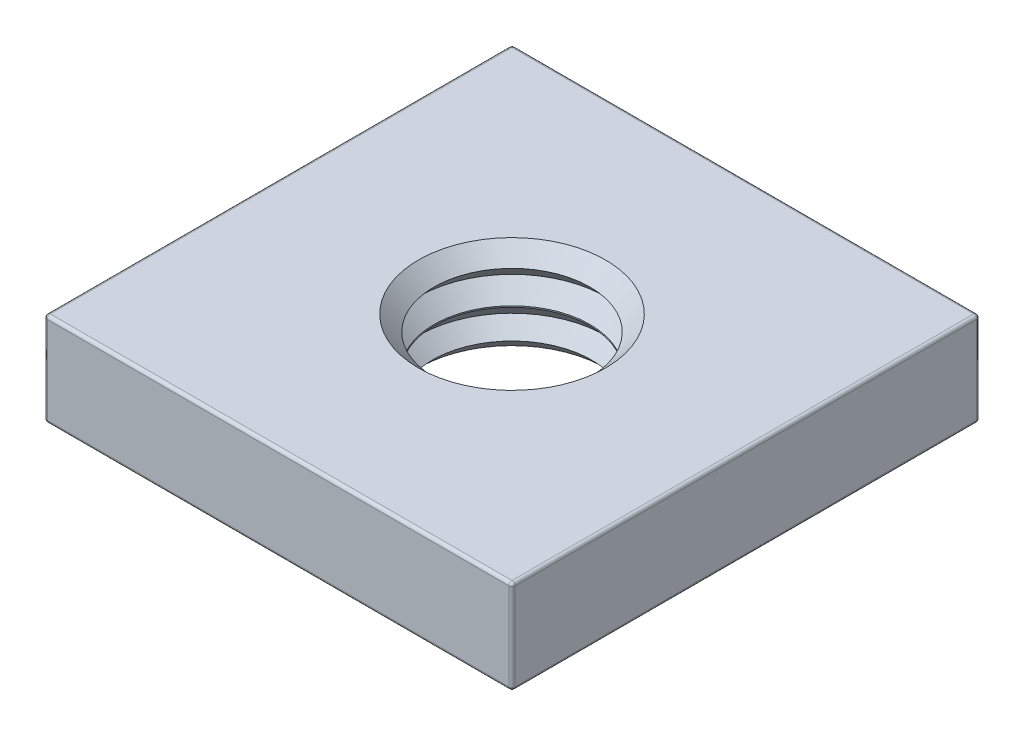
ISO-10303-21;
HEADER;
FILE_DESCRIPTION(('STEP AP214'),'2;1');
FILE_NAME('part.step','',(''),(''),'','','');
FILE_SCHEMA(('AUTOMOTIVE_DESIGN { 1 0 10303 214 1 1 1 1 }'));
ENDSEC;
DATA;
#1=APPLICATION_CONTEXT('core data for automotive mechanical design processes');
#2=APPLICATION_PROTOCOL_DEFINITION('international standard','automotive_design',2000,#1);
#3=PRODUCT_CONTEXT('',#1,'mechanical');
#4=PRODUCT('Part','Part','',(#3));
#5=PRODUCT_RELATED_PRODUCT_CATEGORY('part','',(#4));
#6=PRODUCT_DEFINITION_FORMATION('','',#4);
#7=PRODUCT_DEFINITION_CONTEXT('part definition',#1,'design');
#8=PRODUCT_DEFINITION('design','',#6,#7);
#9=PRODUCT_DEFINITION_SHAPE('','',#8);
#10=(LENGTH_UNIT() NAMED_UNIT(*) SI_UNIT(.MILLI.,.METRE.));
#11=(NAMED_UNIT(*) PLANE_ANGLE_UNIT() SI_UNIT($,.RADIAN.));
#12=(NAMED_UNIT(*) SI_UNIT($,.STERADIAN.) SOLID_ANGLE_UNIT());
#13=UNCERTAINTY_MEASURE_WITH_UNIT(LENGTH_MEASURE(1.E-05),#10,'distance_accuracy_value','');
#14=(GEOMETRIC_REPRESENTATION_CONTEXT(3) GLOBAL_UNCERTAINTY_ASSIGNED_CONTEXT((#13)) GLOBAL_UNIT_ASSIGNED_CONTEXT((#10,
#11,#12)) REPRESENTATION_CONTEXT('',''));
#15=CARTESIAN_POINT('',(0.,0.,0.));
#16=DIRECTION('',(0.,0.,1.));
#17=DIRECTION('',(1.,0.,0.));
#18=AXIS2_PLACEMENT_3D('',#15,#16,#17);
#19=CARTESIAN_POINT('',(-7.5,1.5,-7.5));
#20=DIRECTION('',(1.,0.,0.));
#21=DIRECTION('',(0.,0.,-1.));
#22=AXIS2_PLACEMENT_3D('',#19,#20,#21);
#23=PLANE('',#22);
#24=DIRECTION('',(0.,-1.,0.));
#25=VECTOR('',#24,1.);
#26=CARTESIAN_POINT('',(-7.5,1.5,-7.4));
#27=LINE('',#26,#25);
#28=CARTESIAN_POINT('',(-7.5,1.4,-7.4));
#29=VERTEX_POINT('',#28);
#30=CARTESIAN_POINT('',(-7.5,-1.4,-7.4));
#31=VERTEX_POINT('',#30);
#32=EDGE_CURVE('E117',#29,#31,#27,.T.);
#33=ORIENTED_EDGE('',*,*,#32,.T.);
#34=DIRECTION('',(0.,0.,1.));
#35=VECTOR('',#34,1.);
#36=CARTESIAN_POINT('',(-7.5,-1.4,-7.5));
#37=LINE('',#36,#35);
#38=CARTESIAN_POINT('',(-7.5,-1.4,7.4));
#39=VERTEX_POINT('',#38);
#40=EDGE_CURVE('E113',#31,#39,#37,.T.);
#41=ORIENTED_EDGE('',*,*,#40,.T.);
#42=DIRECTION('',(0.,-1.,0.));
#43=VECTOR('',#42,1.);
#44=CARTESIAN_POINT('',(-7.5,1.5,7.4));
#45=LINE('',#44,#43);
#46=CARTESIAN_POINT('',(-7.5,1.4,7.4));
#47=VERTEX_POINT('',#46);
#48=EDGE_CURVE('E108',#39,#47,#45,.F.);
#49=ORIENTED_EDGE('',*,*,#48,.T.);
#50=DIRECTION('',(0.,0.,1.));
#51=VECTOR('',#50,1.);
#52=CARTESIAN_POINT('',(-7.5,1.4,-7.5));
#53=LINE('',#52,#51);
#54=EDGE_CURVE('E110',#47,#29,#53,.F.);
#55=ORIENTED_EDGE('',*,*,#54,.T.);
#56=EDGE_LOOP('',(#33,#41,#49,#55));
#57=FACE_BOUND('',#56,.T.);
#58=ADVANCED_FACE('F16',(#57),#23,.F.);
#59=CARTESIAN_POINT('',(-7.5,1.5,7.5));
#60=DIRECTION('',(0.,0.,-1.));
#61=DIRECTION('',(-1.,0.,0.));
#62=AXIS2_PLACEMENT_3D('',#59,#60,#61);
#63=PLANE('',#62);
#64=DIRECTION('',(1.,0.,0.));
#65=VECTOR('',#64,1.);
#66=CARTESIAN_POINT('',(-7.5,-1.4,7.5));
#67=LINE('',#66,#65);
#68=CARTESIAN_POINT('',(-7.4,-1.4,7.5));
#69=VERTEX_POINT('',#68);
#70=CARTESIAN_POINT('',(7.4,-1.4,7.5));
#71=VERTEX_POINT('',#70);
#72=EDGE_CURVE('E226',#69,#71,#67,.T.);
#73=ORIENTED_EDGE('',*,*,#72,.T.);
#74=DIRECTION('',(0.,-1.,0.));
#75=VECTOR('',#74,1.);
#76=CARTESIAN_POINT('',(7.4,1.5,7.5));
#77=LINE('',#76,#75);
#78=CARTESIAN_POINT('',(7.4,1.4,7.5));
#79=VERTEX_POINT('',#78);
#80=EDGE_CURVE('E229',#71,#79,#77,.F.);
#81=ORIENTED_EDGE('',*,*,#80,.T.);
#82=DIRECTION('',(1.,0.,0.));
#83=VECTOR('',#82,1.);
#84=CARTESIAN_POINT('',(-7.5,1.4,7.5));
#85=LINE('',#84,#83);
#86=CARTESIAN_POINT('',(-7.4,1.4,7.5));
#87=VERTEX_POINT('',#86);
#88=EDGE_CURVE('E224',#79,#87,#85,.F.);
#89=ORIENTED_EDGE('',*,*,#88,.T.);
#90=DIRECTION('',(0.,-1.,0.));
#91=VECTOR('',#90,1.);
#92=CARTESIAN_POINT('',(-7.4,1.5,7.5));
#93=LINE('',#92,#91);
#94=EDGE_CURVE('E140',#87,#69,#93,.T.);
#95=ORIENTED_EDGE('',*,*,#94,.T.);
#96=EDGE_LOOP('',(#73,#81,#89,#95));
#97=FACE_BOUND('',#96,.T.);
#98=ADVANCED_FACE('F294',(#97),#63,.F.);
#99=CARTESIAN_POINT('',(7.5,1.5,-7.5));
#100=DIRECTION('',(-1.,0.,0.));
#101=DIRECTION('',(0.,0.,1.));
#102=AXIS2_PLACEMENT_3D('',#99,#100,#101);
#103=PLANE('',#102);
#104=DIRECTION('',(0.,0.,-1.));
#105=VECTOR('',#104,1.);
#106=CARTESIAN_POINT('',(7.5,-1.4,-7.5));
#107=LINE('',#106,#105);
#108=CARTESIAN_POINT('',(7.5,-1.4,7.4));
#109=VERTEX_POINT('',#108);
#110=CARTESIAN_POINT('',(7.5,-1.4,-7.4));
#111=VERTEX_POINT('',#110);
#112=EDGE_CURVE('E235',#109,#111,#107,.T.);
#113=ORIENTED_EDGE('',*,*,#112,.T.);
#114=DIRECTION('',(0.,-1.,0.));
#115=VECTOR('',#114,1.);
#116=CARTESIAN_POINT('',(7.5,1.5,-7.4));
#117=LINE('',#116,#115);
#118=CARTESIAN_POINT('',(7.5,1.4,-7.4));
#119=VERTEX_POINT('',#118);
#120=EDGE_CURVE('E238',#111,#119,#117,.F.);
#121=ORIENTED_EDGE('',*,*,#120,.T.);
#122=DIRECTION('',(0.,0.,-1.));
#123=VECTOR('',#122,1.);
#124=CARTESIAN_POINT('',(7.5,1.4,7.5));
#125=LINE('',#124,#123);
#126=CARTESIAN_POINT('',(7.5,1.4,7.4));
#127=VERTEX_POINT('',#126);
#128=EDGE_CURVE('E233',#119,#127,#125,.F.);
#129=ORIENTED_EDGE('',*,*,#128,.T.);
#130=DIRECTION('',(0.,-1.,0.));
#131=VECTOR('',#130,1.);
#132=CARTESIAN_POINT('',(7.5,1.5,7.4));
#133=LINE('',#132,#131);
#134=EDGE_CURVE('E231',#127,#109,#133,.T.);
#135=ORIENTED_EDGE('',*,*,#134,.T.);
#136=EDGE_LOOP('',(#113,#121,#129,#135));
#137=FACE_BOUND('',#136,.T.);
#138=ADVANCED_FACE('F344',(#137),#103,.F.);
#139=CARTESIAN_POINT('',(-7.5,1.5,-7.5));
#140=DIRECTION('',(0.,0.,1.));
#141=DIRECTION('',(1.,0.,0.));
#142=AXIS2_PLACEMENT_3D('',#139,#140,#141);
#143=PLANE('',#142);
#144=DIRECTION('',(0.,-1.,0.));
#145=VECTOR('',#144,1.);
#146=CARTESIAN_POINT('',(7.4,1.5,-7.5));
#147=LINE('',#146,#145);
#148=CARTESIAN_POINT('',(7.4,1.4,-7.5));
#149=VERTEX_POINT('',#148);
#150=CARTESIAN_POINT('',(7.4,-1.4,-7.5));
#151=VERTEX_POINT('',#150);
#152=EDGE_CURVE('E242',#149,#151,#147,.T.);
#153=ORIENTED_EDGE('',*,*,#152,.T.);
#154=DIRECTION('',(-1.,0.,0.));
#155=VECTOR('',#154,1.);
#156=CARTESIAN_POINT('',(-7.5,-1.4,-7.5));
#157=LINE('',#156,#155);
#158=CARTESIAN_POINT('',(-7.4,-1.4,-7.5));
#159=VERTEX_POINT('',#158);
#160=EDGE_CURVE('E246',#151,#159,#157,.T.);
#161=ORIENTED_EDGE('',*,*,#160,.T.);
#162=DIRECTION('',(0.,-1.,0.));
#163=VECTOR('',#162,1.);
#164=CARTESIAN_POINT('',(-7.4,1.5,-7.5));
#165=LINE('',#164,#163);
#166=CARTESIAN_POINT('',(-7.4,1.4,-7.5));
#167=VERTEX_POINT('',#166);
#168=EDGE_CURVE('E244',#159,#167,#165,.F.);
#169=ORIENTED_EDGE('',*,*,#168,.T.);
#170=DIRECTION('',(-1.,0.,0.));
#171=VECTOR('',#170,1.);
#172=CARTESIAN_POINT('',(7.5,1.4,-7.5));
#173=LINE('',#172,#171);
#174=EDGE_CURVE('E240',#167,#149,#173,.F.);
#175=ORIENTED_EDGE('',*,*,#174,.T.);
#176=EDGE_LOOP('',(#153,#161,#169,#175));
#177=FACE_BOUND('',#176,.T.);
#178=ADVANCED_FACE('F310',(#177),#143,.F.);
#179=CARTESIAN_POINT('',(0.,1.5,0.));
#180=DIRECTION('',(0.,1.,0.));
#181=DIRECTION('',(0.,0.,1.));
#182=AXIS2_PLACEMENT_3D('',#179,#180,#181);
#183=PLANE('',#182);
#184=DIRECTION('',(0.,0.,1.));
#185=VECTOR('',#184,1.);
#186=CARTESIAN_POINT('',(-7.4,1.5,7.5));
#187=LINE('',#186,#185);
#188=CARTESIAN_POINT('',(-7.4,1.5,-7.4));
#189=VERTEX_POINT('',#188);
#190=CARTESIAN_POINT('',(-7.4,1.5,7.4));
#191=VERTEX_POINT('',#190);
#192=EDGE_CURVE('E249',#189,#191,#187,.T.);
#193=ORIENTED_EDGE('',*,*,#192,.T.);
#194=DIRECTION('',(1.,0.,0.));
#195=VECTOR('',#194,1.);
#196=CARTESIAN_POINT('',(7.5,1.5,7.4));
#197=LINE('',#196,#195);
#198=CARTESIAN_POINT('',(7.4,1.5,7.4));
#199=VERTEX_POINT('',#198);
#200=EDGE_CURVE('E10',#191,#199,#197,.T.);
#201=ORIENTED_EDGE('',*,*,#200,.T.);
#202=DIRECTION('',(0.,0.,-1.));
#203=VECTOR('',#202,1.);
#204=CARTESIAN_POINT('',(7.4,1.5,-7.5));
#205=LINE('',#204,#203);
#206=CARTESIAN_POINT('',(7.4,1.5,-7.4));
#207=VERTEX_POINT('',#206);
#208=EDGE_CURVE('E25',#199,#207,#205,.T.);
#209=ORIENTED_EDGE('',*,*,#208,.T.);
#210=DIRECTION('',(-1.,0.,0.));
#211=VECTOR('',#210,1.);
#212=CARTESIAN_POINT('',(-7.5,1.5,-7.4));
#213=LINE('',#212,#211);
#214=EDGE_CURVE('E251',#207,#189,#213,.T.);
#215=ORIENTED_EDGE('',*,*,#214,.T.);
#216=EDGE_LOOP('',(#193,#201,#209,#215));
#217=FACE_BOUND('',#216,.T.);
#218=CARTESIAN_POINT('',(0.,1.5,0.));
#219=DIRECTION('',(0.,1.,0.));
#220=DIRECTION('',(0.,0.,1.));
#221=AXIS2_PLACEMENT_3D('',#218,#219,#220);
#222=CIRCLE('',#221,3.);
#223=CARTESIAN_POINT('',(0.,1.5,3.));
#224=VERTEX_POINT('',#223);
#225=EDGE_CURVE('E129',#224,#224,#222,.F.);
#226=ORIENTED_EDGE('',*,*,#225,.T.);
#227=EDGE_LOOP('',(#226));
#228=FACE_BOUND('',#227,.T.);
#229=ADVANCED_FACE('F297',(#217,#228),#183,.T.);
#230=CARTESIAN_POINT('',(0.,-1.5,0.));
#231=DIRECTION('',(0.,1.,0.));
#232=DIRECTION('',(0.,0.,1.));
#233=AXIS2_PLACEMENT_3D('',#230,#231,#232);
#234=PLANE('',#233);
#235=DIRECTION('',(1.,0.,0.));
#236=VECTOR('',#235,1.);
#237=CARTESIAN_POINT('',(0.,-1.5,7.4));
#238=LINE('',#237,#236);
#239=CARTESIAN_POINT('',(7.4,-1.5,7.4));
#240=VERTEX_POINT('',#239);
#241=CARTESIAN_POINT('',(-7.4,-1.5,7.4));
#242=VERTEX_POINT('',#241);
#243=EDGE_CURVE('E218',#240,#242,#238,.F.);
#244=ORIENTED_EDGE('',*,*,#243,.T.);
#245=DIRECTION('',(0.,0.,1.));
#246=VECTOR('',#245,1.);
#247=CARTESIAN_POINT('',(-7.4,-1.5,0.));
#248=LINE('',#247,#246);
#249=CARTESIAN_POINT('',(-7.4,-1.5,-7.4));
#250=VERTEX_POINT('',#249);
#251=EDGE_CURVE('E220',#242,#250,#248,.F.);
#252=ORIENTED_EDGE('',*,*,#251,.T.);
#253=DIRECTION('',(-1.,0.,0.));
#254=VECTOR('',#253,1.);
#255=CARTESIAN_POINT('',(0.,-1.5,-7.4));
#256=LINE('',#255,#254);
#257=CARTESIAN_POINT('',(7.4,-1.5,-7.4));
#258=VERTEX_POINT('',#257);
#259=EDGE_CURVE('E214',#250,#258,#256,.F.);
#260=ORIENTED_EDGE('',*,*,#259,.T.);
#261=DIRECTION('',(0.,0.,-1.));
#262=VECTOR('',#261,1.);
#263=CARTESIAN_POINT('',(7.4,-1.5,0.));
#264=LINE('',#263,#262);
#265=EDGE_CURVE('E216',#258,#240,#264,.F.);
#266=ORIENTED_EDGE('',*,*,#265,.T.);
#267=EDGE_LOOP('',(#244,#252,#260,#266));
#268=FACE_BOUND('',#267,.T.);
#269=CARTESIAN_POINT('',(0.,-1.5,0.));
#270=DIRECTION('',(0.,1.,0.));
#271=DIRECTION('',(0.,0.,1.));
#272=AXIS2_PLACEMENT_3D('',#269,#270,#271);
#273=CIRCLE('',#272,3.);
#274=CARTESIAN_POINT('',(0.,-1.5,3.));
#275=VERTEX_POINT('',#274);
#276=EDGE_CURVE('E205',#275,#275,#273,.T.);
#277=ORIENTED_EDGE('',*,*,#276,.T.);
#278=EDGE_LOOP('',(#277));
#279=FACE_BOUND('',#278,.T.);
#280=ADVANCED_FACE('F280',(#268,#279),#234,.F.);
#281=CARTESIAN_POINT('',(0.,-1.5,0.));
#282=DIRECTION('',(0.,1.,0.));
#283=DIRECTION('',(0.,0.,1.));
#284=AXIS2_PLACEMENT_3D('',#281,#282,#283);
#285=CYLINDRICAL_SURFACE('',#284,2.5);
#286=CARTESIAN_POINT('',(0.,-0.0800000000000009,0.));
#287=DIRECTION('',(0.,1.,0.));
#288=DIRECTION('',(0.,0.,1.));
#289=AXIS2_PLACEMENT_3D('',#286,#287,#288);
#290=CIRCLE('',#289,2.5);
#291=CARTESIAN_POINT('',(0.,-0.0800000000000009,2.5));
#292=VERTEX_POINT('',#291);
#293=EDGE_CURVE('E183',#292,#292,#290,.T.);
#294=ORIENTED_EDGE('',*,*,#293,.F.);
#295=EDGE_LOOP('',(#294));
#296=FACE_BOUND('',#295,.T.);
#297=CARTESIAN_POINT('',(0.,-0.040000000000001,0.));
#298=DIRECTION('',(0.,1.,0.));
#299=DIRECTION('',(0.,0.,1.));
#300=AXIS2_PLACEMENT_3D('',#297,#298,#299);
#301=CIRCLE('',#300,2.5);
#302=CARTESIAN_POINT('',(0.,-0.040000000000001,2.5));
#303=VERTEX_POINT('',#302);
#304=EDGE_CURVE('E202',#303,#303,#301,.T.);
#305=ORIENTED_EDGE('',*,*,#304,.T.);
#306=EDGE_LOOP('',(#305));
#307=FACE_BOUND('',#306,.T.);
#308=ADVANCED_FACE('F352',(#296,#307),#285,.F.);
#309=CARTESIAN_POINT('',(0.,-1.5,0.));
#310=DIRECTION('',(0.,-1.,0.));
#311=DIRECTION('',(0.,0.,-1.));
#312=AXIS2_PLACEMENT_3D('',#309,#310,#311);
#313=CONICAL_SURFACE('',#312,3.,0.785398163397448);
#314=CARTESIAN_POINT('',(0.,-1.05882352941176,0.));
#315=DIRECTION('',(0.,1.,0.));
#316=DIRECTION('',(0.,0.,1.));
#317=AXIS2_PLACEMENT_3D('',#314,#315,#316);
#318=CIRCLE('',#317,2.55882352941177);
#319=CARTESIAN_POINT('',(0.,-1.05882352941176,2.55882352941177));
#320=VERTEX_POINT('',#319);
#321=EDGE_CURVE('E193',#320,#320,#318,.F.);
#322=ORIENTED_EDGE('',*,*,#321,.F.);
#323=EDGE_LOOP('',(#322));
#324=FACE_BOUND('',#323,.T.);
#325=ORIENTED_EDGE('',*,*,#276,.F.);
#326=EDGE_LOOP('',(#325));
#327=FACE_BOUND('',#326,.T.);
#328=ADVANCED_FACE('F348',(#324,#327),#313,.F.);
#329=CARTESIAN_POINT('',(0.,0.999999999999999,0.));
#330=DIRECTION('',(0.,1.,0.));
#331=DIRECTION('',(0.,0.,1.));
#332=AXIS2_PLACEMENT_3D('',#329,#330,#331);
#333=CONICAL_SURFACE('',#332,2.5,0.78539816339745);
#334=ORIENTED_EDGE('',*,*,#225,.F.);
#335=EDGE_LOOP('',(#334));
#336=FACE_BOUND('',#335,.T.);
#337=CARTESIAN_POINT('',(0.,0.999999999999999,0.));
#338=DIRECTION('',(0.,1.,0.));
#339=DIRECTION('',(0.,0.,1.));
#340=AXIS2_PLACEMENT_3D('',#337,#338,#339);
#341=CIRCLE('',#340,2.5);
#342=CARTESIAN_POINT('',(0.,0.999999999999999,2.5));
#343=VERTEX_POINT('',#342);
#344=EDGE_CURVE('E196',#343,#343,#341,.T.);
#345=ORIENTED_EDGE('',*,*,#344,.F.);
#346=EDGE_LOOP('',(#345));
#347=FACE_BOUND('',#346,.T.);
#348=ADVANCED_FACE('F351',(#336,#347),#333,.F.);
#349=CARTESIAN_POINT('',(0.,0.48,0.));
#350=DIRECTION('',(0.,1.,0.));
#351=DIRECTION('',(0.,0.,1.));
#352=AXIS2_PLACEMENT_3D('',#349,#350,#351);
#353=CONICAL_SURFACE('',#352,3.,0.765792832540243);
#354=ORIENTED_EDGE('',*,*,#304,.F.);
#355=EDGE_LOOP('',(#354));
#356=FACE_BOUND('',#355,.T.);
#357=CARTESIAN_POINT('',(0.,0.48,0.));
#358=DIRECTION('',(0.,1.,0.));
#359=DIRECTION('',(0.,0.,1.));
#360=AXIS2_PLACEMENT_3D('',#357,#358,#359);
#361=CIRCLE('',#360,3.);
#362=CARTESIAN_POINT('',(0.,0.48,3.));
#363=VERTEX_POINT('',#362);
#364=EDGE_CURVE('E199',#363,#363,#361,.T.);
#365=ORIENTED_EDGE('',*,*,#364,.T.);
#366=EDGE_LOOP('',(#365));
#367=FACE_BOUND('',#366,.T.);
#368=ADVANCED_FACE('F356',(#356,#367),#353,.F.);
#369=CARTESIAN_POINT('',(0.,0.999999999999999,0.));
#370=DIRECTION('',(0.,-1.,0.));
#371=DIRECTION('',(0.,0.,-1.));
#372=AXIS2_PLACEMENT_3D('',#369,#370,#371);
#373=CONICAL_SURFACE('',#372,2.5,0.765792832540244);
#374=ORIENTED_EDGE('',*,*,#364,.F.);
#375=EDGE_LOOP('',(#374));
#376=FACE_BOUND('',#375,.T.);
#377=ORIENTED_EDGE('',*,*,#344,.T.);
#378=EDGE_LOOP('',(#377));
#379=FACE_BOUND('',#378,.T.);
#380=ADVANCED_FACE('F551',(#376,#379),#373,.F.);
#381=CARTESIAN_POINT('',(0.,-0.600000000000001,0.));
#382=DIRECTION('',(0.,1.,0.));
#383=DIRECTION('',(0.,0.,1.));
#384=AXIS2_PLACEMENT_3D('',#381,#382,#383);
#385=CONICAL_SURFACE('',#384,3.,0.765792832540243);
#386=ORIENTED_EDGE('',*,*,#321,.T.);
#387=EDGE_LOOP('',(#386));
#388=FACE_BOUND('',#387,.T.);
#389=CARTESIAN_POINT('',(0.,-0.600000000000001,0.));
#390=DIRECTION('',(0.,1.,0.));
#391=DIRECTION('',(0.,0.,1.));
#392=AXIS2_PLACEMENT_3D('',#389,#390,#391);
#393=CIRCLE('',#392,3.);
#394=CARTESIAN_POINT('',(0.,-0.600000000000001,3.));
#395=VERTEX_POINT('',#394);
#396=EDGE_CURVE('E188',#395,#395,#393,.T.);
#397=ORIENTED_EDGE('',*,*,#396,.T.);
#398=EDGE_LOOP('',(#397));
#399=FACE_BOUND('',#398,.T.);
#400=ADVANCED_FACE('F542',(#388,#399),#385,.F.);
#401=CARTESIAN_POINT('',(0.,-0.0800000000000009,0.));
#402=DIRECTION('',(0.,-1.,0.));
#403=DIRECTION('',(0.,0.,-1.));
#404=AXIS2_PLACEMENT_3D('',#401,#402,#403);
#405=CONICAL_SURFACE('',#404,2.5,0.765792832540244);
#406=ORIENTED_EDGE('',*,*,#396,.F.);
#407=EDGE_LOOP('',(#406));
#408=FACE_BOUND('',#407,.T.);
#409=ORIENTED_EDGE('',*,*,#293,.T.);
#410=EDGE_LOOP('',(#409));
#411=FACE_BOUND('',#410,.T.);
#412=ADVANCED_FACE('F503',(#408,#411),#405,.F.);
#413=CARTESIAN_POINT('',(7.4,1.4,0.));
#414=DIRECTION('',(0.,0.,1.));
#415=DIRECTION('',(1.,0.,0.));
#416=AXIS2_PLACEMENT_3D('',#413,#414,#415);
#417=CYLINDRICAL_SURFACE('',#416,0.1);
#418=CARTESIAN_POINT('',(7.4,1.4,-7.4));
#419=DIRECTION('',(0.,0.,-1.));
#420=DIRECTION('',(-1.,0.,0.));
#421=AXIS2_PLACEMENT_3D('',#418,#419,#420);
#422=CIRCLE('',#421,0.1);
#423=EDGE_CURVE('E20',#207,#119,#422,.T.);
#424=ORIENTED_EDGE('',*,*,#423,.F.);
#425=ORIENTED_EDGE('',*,*,#208,.F.);
#426=CARTESIAN_POINT('',(7.4,1.4,7.4));
#427=DIRECTION('',(0.,0.,1.));
#428=DIRECTION('',(0.,-1.,0.));
#429=AXIS2_PLACEMENT_3D('',#426,#427,#428);
#430=CIRCLE('',#429,0.1);
#431=EDGE_CURVE('E178',#127,#199,#430,.T.);
#432=ORIENTED_EDGE('',*,*,#431,.F.);
#433=ORIENTED_EDGE('',*,*,#128,.F.);
#434=EDGE_LOOP('',(#424,#425,#432,#433));
#435=FACE_BOUND('',#434,.T.);
#436=ADVANCED_FACE('F18',(#435),#417,.T.);
#437=CARTESIAN_POINT('',(7.4,1.4,-7.4));
#438=DIRECTION('',(0.,0.,1.));
#439=DIRECTION('',(1.,0.,0.));
#440=AXIS2_PLACEMENT_3D('',#437,#438,#439);
#441=SPHERICAL_SURFACE('',#440,0.1);
#442=CARTESIAN_POINT('',(7.4,1.4,-7.4));
#443=DIRECTION('',(1.,0.,0.));
#444=DIRECTION('',(0.,1.,0.));
#445=AXIS2_PLACEMENT_3D('',#442,#443,#444);
#446=CIRCLE('',#445,0.1);
#447=EDGE_CURVE('E173',#207,#149,#446,.F.);
#448=ORIENTED_EDGE('',*,*,#447,.F.);
#449=ORIENTED_EDGE('',*,*,#423,.T.);
#450=CARTESIAN_POINT('',(7.4,1.4,-7.4));
#451=DIRECTION('',(0.,1.,0.));
#452=DIRECTION('',(0.,0.,1.));
#453=AXIS2_PLACEMENT_3D('',#450,#451,#452);
#454=CIRCLE('',#453,0.1);
#455=EDGE_CURVE('E176',#149,#119,#454,.F.);
#456=ORIENTED_EDGE('',*,*,#455,.F.);
#457=EDGE_LOOP('',(#448,#449,#456));
#458=FACE_BOUND('',#457,.T.);
#459=ADVANCED_FACE('F331',(#458),#441,.T.);
#460=CARTESIAN_POINT('',(7.4,1.4,7.4));
#461=DIRECTION('',(0.,0.,1.));
#462=DIRECTION('',(1.,0.,0.));
#463=AXIS2_PLACEMENT_3D('',#460,#461,#462);
#464=SPHERICAL_SURFACE('',#463,0.1);
#465=CARTESIAN_POINT('',(7.4,1.4,7.4));
#466=DIRECTION('',(0.,1.,0.));
#467=DIRECTION('',(0.,0.,1.));
#468=AXIS2_PLACEMENT_3D('',#465,#466,#467);
#469=CIRCLE('',#468,0.1);
#470=EDGE_CURVE('E169',#127,#79,#469,.F.);
#471=ORIENTED_EDGE('',*,*,#470,.F.);
#472=ORIENTED_EDGE('',*,*,#431,.T.);
#473=CARTESIAN_POINT('',(7.4,1.4,7.4));
#474=DIRECTION('',(1.,0.,0.));
#475=DIRECTION('',(0.,0.,-1.));
#476=AXIS2_PLACEMENT_3D('',#473,#474,#475);
#477=CIRCLE('',#476,0.1);
#478=EDGE_CURVE('E33',#79,#199,#477,.F.);
#479=ORIENTED_EDGE('',*,*,#478,.F.);
#480=EDGE_LOOP('',(#471,#472,#479));
#481=FACE_BOUND('',#480,.T.);
#482=ADVANCED_FACE('F329',(#481),#464,.T.);
#483=CARTESIAN_POINT('',(7.4,1.5,-7.4));
#484=DIRECTION('',(0.,-1.,0.));
#485=DIRECTION('',(0.,0.,-1.));
#486=AXIS2_PLACEMENT_3D('',#483,#484,#485);
#487=CYLINDRICAL_SURFACE('',#486,0.1);
#488=ORIENTED_EDGE('',*,*,#455,.T.);
#489=ORIENTED_EDGE('',*,*,#120,.F.);
#490=CARTESIAN_POINT('',(7.4,-1.4,-7.4));
#491=DIRECTION('',(0.,-1.,0.));
#492=DIRECTION('',(0.,0.,-1.));
#493=AXIS2_PLACEMENT_3D('',#490,#491,#492);
#494=CIRCLE('',#493,0.1);
#495=EDGE_CURVE('E164',#151,#111,#494,.T.);
#496=ORIENTED_EDGE('',*,*,#495,.F.);
#497=ORIENTED_EDGE('',*,*,#152,.F.);
#498=EDGE_LOOP('',(#488,#489,#496,#497));
#499=FACE_BOUND('',#498,.T.);
#500=ADVANCED_FACE('F315',(#499),#487,.T.);
#501=CARTESIAN_POINT('',(0.,1.4,-7.4));
#502=DIRECTION('',(1.,0.,0.));
#503=DIRECTION('',(0.,0.,-1.));
#504=AXIS2_PLACEMENT_3D('',#501,#502,#503);
#505=CYLINDRICAL_SURFACE('',#504,0.1);
#506=ORIENTED_EDGE('',*,*,#447,.T.);
#507=ORIENTED_EDGE('',*,*,#174,.F.);
#508=CARTESIAN_POINT('',(-7.4,1.4,-7.4));
#509=DIRECTION('',(-1.,0.,0.));
#510=DIRECTION('',(0.,0.,1.));
#511=AXIS2_PLACEMENT_3D('',#508,#509,#510);
#512=CIRCLE('',#511,0.1);
#513=EDGE_CURVE('E161',#189,#167,#512,.T.);
#514=ORIENTED_EDGE('',*,*,#513,.F.);
#515=ORIENTED_EDGE('',*,*,#214,.F.);
#516=EDGE_LOOP('',(#506,#507,#514,#515));
#517=FACE_BOUND('',#516,.T.);
#518=ADVANCED_FACE('F303',(#517),#505,.T.);
#519=CARTESIAN_POINT('',(-7.4,1.4,0.));
#520=DIRECTION('',(0.,0.,-1.));
#521=DIRECTION('',(-1.,0.,0.));
#522=AXIS2_PLACEMENT_3D('',#519,#520,#521);
#523=CYLINDRICAL_SURFACE('',#522,0.1);
#524=CARTESIAN_POINT('',(-7.4,1.4,7.4));
#525=DIRECTION('',(0.,0.,1.));
#526=DIRECTION('',(1.,0.,0.));
#527=AXIS2_PLACEMENT_3D('',#524,#525,#526);
#528=CIRCLE('',#527,0.1);
#529=EDGE_CURVE('E124',#191,#47,#528,.T.);
#530=ORIENTED_EDGE('',*,*,#529,.F.);
#531=ORIENTED_EDGE('',*,*,#192,.F.);
#532=CARTESIAN_POINT('',(-7.4,1.4,-7.4));
#533=DIRECTION('',(0.,0.,-1.));
#534=DIRECTION('',(-1.,0.,0.));
#535=AXIS2_PLACEMENT_3D('',#532,#533,#534);
#536=CIRCLE('',#535,0.1);
#537=EDGE_CURVE('E127',#29,#189,#536,.T.);
#538=ORIENTED_EDGE('',*,*,#537,.F.);
#539=ORIENTED_EDGE('',*,*,#54,.F.);
#540=EDGE_LOOP('',(#530,#531,#538,#539));
#541=FACE_BOUND('',#540,.T.);
#542=ADVANCED_FACE('F122',(#541),#523,.T.);
#543=CARTESIAN_POINT('',(0.,1.4,7.4));
#544=DIRECTION('',(-1.,0.,0.));
#545=DIRECTION('',(0.,0.,1.));
#546=AXIS2_PLACEMENT_3D('',#543,#544,#545);
#547=CYLINDRICAL_SURFACE('',#546,0.1);
#548=ORIENTED_EDGE('',*,*,#478,.T.);
#549=ORIENTED_EDGE('',*,*,#200,.F.);
#550=CARTESIAN_POINT('',(-7.4,1.4,7.4));
#551=DIRECTION('',(-1.,0.,0.));
#552=DIRECTION('',(0.,-1.,0.));
#553=AXIS2_PLACEMENT_3D('',#550,#551,#552);
#554=CIRCLE('',#553,0.1);
#555=EDGE_CURVE('E137',#87,#191,#554,.T.);
#556=ORIENTED_EDGE('',*,*,#555,.F.);
#557=ORIENTED_EDGE('',*,*,#88,.F.);
#558=EDGE_LOOP('',(#548,#549,#556,#557));
#559=FACE_BOUND('',#558,.T.);
#560=ADVANCED_FACE('F296',(#559),#547,.T.);
#561=CARTESIAN_POINT('',(7.4,1.5,7.4));
#562=DIRECTION('',(0.,-1.,0.));
#563=DIRECTION('',(0.,0.,-1.));
#564=AXIS2_PLACEMENT_3D('',#561,#562,#563);
#565=CYLINDRICAL_SURFACE('',#564,0.1);
#566=ORIENTED_EDGE('',*,*,#470,.T.);
#567=ORIENTED_EDGE('',*,*,#80,.F.);
#568=CARTESIAN_POINT('',(7.4,-1.4,7.4));
#569=DIRECTION('',(0.,-1.,0.));
#570=DIRECTION('',(0.,0.,-1.));
#571=AXIS2_PLACEMENT_3D('',#568,#569,#570);
#572=CIRCLE('',#571,0.1);
#573=EDGE_CURVE('E156',#109,#71,#572,.T.);
#574=ORIENTED_EDGE('',*,*,#573,.F.);
#575=ORIENTED_EDGE('',*,*,#134,.F.);
#576=EDGE_LOOP('',(#566,#567,#574,#575));
#577=FACE_BOUND('',#576,.T.);
#578=ADVANCED_FACE('F328',(#577),#565,.T.);
#579=CARTESIAN_POINT('',(7.4,-1.4,-7.5));
#580=DIRECTION('',(0.,0.,-1.));
#581=DIRECTION('',(-1.,0.,0.));
#582=AXIS2_PLACEMENT_3D('',#579,#580,#581);
#583=CYLINDRICAL_SURFACE('',#582,0.1);
#584=CARTESIAN_POINT('',(7.4,-1.4,-7.4));
#585=DIRECTION('',(0.,0.,-1.));
#586=DIRECTION('',(-1.,0.,0.));
#587=AXIS2_PLACEMENT_3D('',#584,#585,#586);
#588=CIRCLE('',#587,0.1);
#589=EDGE_CURVE('E166',#111,#258,#588,.T.);
#590=ORIENTED_EDGE('',*,*,#589,.F.);
#591=ORIENTED_EDGE('',*,*,#112,.F.);
#592=CARTESIAN_POINT('',(7.4,-1.4,7.4));
#593=DIRECTION('',(0.,0.,1.));
#594=DIRECTION('',(1.,0.,0.));
#595=AXIS2_PLACEMENT_3D('',#592,#593,#594);
#596=CIRCLE('',#595,0.1);
#597=EDGE_CURVE('E153',#240,#109,#596,.T.);
#598=ORIENTED_EDGE('',*,*,#597,.F.);
#599=ORIENTED_EDGE('',*,*,#265,.F.);
#600=EDGE_LOOP('',(#590,#591,#598,#599));
#601=FACE_BOUND('',#600,.T.);
#602=ADVANCED_FACE('F321',(#601),#583,.T.);
#603=CARTESIAN_POINT('',(7.4,-1.4,-7.4));
#604=DIRECTION('',(0.,0.,1.));
#605=DIRECTION('',(1.,0.,0.));
#606=AXIS2_PLACEMENT_3D('',#603,#604,#605);
#607=SPHERICAL_SURFACE('',#606,0.1);
#608=ORIENTED_EDGE('',*,*,#495,.T.);
#609=ORIENTED_EDGE('',*,*,#589,.T.);
#610=CARTESIAN_POINT('',(7.4,-1.4,-7.4));
#611=DIRECTION('',(1.,0.,0.));
#612=DIRECTION('',(0.,0.,-1.));
#613=AXIS2_PLACEMENT_3D('',#610,#611,#612);
#614=CIRCLE('',#613,0.1);
#615=EDGE_CURVE('E145',#151,#258,#614,.F.);
#616=ORIENTED_EDGE('',*,*,#615,.F.);
#617=EDGE_LOOP('',(#608,#609,#616));
#618=FACE_BOUND('',#617,.T.);
#619=ADVANCED_FACE('F318',(#618),#607,.T.);
#620=CARTESIAN_POINT('',(-7.4,1.4,-7.4));
#621=DIRECTION('',(0.,0.,1.));
#622=DIRECTION('',(1.,0.,0.));
#623=AXIS2_PLACEMENT_3D('',#620,#621,#622);
#624=SPHERICAL_SURFACE('',#623,0.1);
#625=ORIENTED_EDGE('',*,*,#537,.T.);
#626=ORIENTED_EDGE('',*,*,#513,.T.);
#627=CARTESIAN_POINT('',(-7.4,1.4,-7.4));
#628=DIRECTION('',(0.,1.,0.));
#629=DIRECTION('',(0.,0.,1.));
#630=AXIS2_PLACEMENT_3D('',#627,#628,#629);
#631=CIRCLE('',#630,0.1);
#632=EDGE_CURVE('E141',#29,#167,#631,.F.);
#633=ORIENTED_EDGE('',*,*,#632,.F.);
#634=EDGE_LOOP('',(#625,#626,#633));
#635=FACE_BOUND('',#634,.T.);
#636=ADVANCED_FACE('F305',(#635),#624,.T.);
#637=CARTESIAN_POINT('',(-7.4,1.4,7.4));
#638=DIRECTION('',(0.,0.,1.));
#639=DIRECTION('',(1.,0.,0.));
#640=AXIS2_PLACEMENT_3D('',#637,#638,#639);
#641=SPHERICAL_SURFACE('',#640,0.1);
#642=ORIENTED_EDGE('',*,*,#555,.T.);
#643=ORIENTED_EDGE('',*,*,#529,.T.);
#644=CARTESIAN_POINT('',(-7.4,1.4,7.4));
#645=DIRECTION('',(0.,1.,0.));
#646=DIRECTION('',(0.,0.,1.));
#647=AXIS2_PLACEMENT_3D('',#644,#645,#646);
#648=CIRCLE('',#647,0.1);
#649=EDGE_CURVE('E134',#87,#47,#648,.F.);
#650=ORIENTED_EDGE('',*,*,#649,.F.);
#651=EDGE_LOOP('',(#642,#643,#650));
#652=FACE_BOUND('',#651,.T.);
#653=ADVANCED_FACE('F133',(#652),#641,.T.);
#654=CARTESIAN_POINT('',(7.4,-1.4,7.4));
#655=DIRECTION('',(0.,0.,1.));
#656=DIRECTION('',(1.,0.,0.));
#657=AXIS2_PLACEMENT_3D('',#654,#655,#656);
#658=SPHERICAL_SURFACE('',#657,0.1);
#659=ORIENTED_EDGE('',*,*,#597,.T.);
#660=ORIENTED_EDGE('',*,*,#573,.T.);
#661=CARTESIAN_POINT('',(7.4,-1.4,7.4));
#662=DIRECTION('',(1.,0.,0.));
#663=DIRECTION('',(0.,0.,-1.));
#664=AXIS2_PLACEMENT_3D('',#661,#662,#663);
#665=CIRCLE('',#664,0.1);
#666=EDGE_CURVE('E142',#240,#71,#665,.F.);
#667=ORIENTED_EDGE('',*,*,#666,.F.);
#668=EDGE_LOOP('',(#659,#660,#667));
#669=FACE_BOUND('',#668,.T.);
#670=ADVANCED_FACE('F325',(#669),#658,.T.);
#671=CARTESIAN_POINT('',(-7.5,-1.4,-7.4));
#672=DIRECTION('',(-1.,0.,0.));
#673=DIRECTION('',(0.,0.,1.));
#674=AXIS2_PLACEMENT_3D('',#671,#672,#673);
#675=CYLINDRICAL_SURFACE('',#674,0.1);
#676=ORIENTED_EDGE('',*,*,#615,.T.);
#677=ORIENTED_EDGE('',*,*,#259,.F.);
#678=CARTESIAN_POINT('',(-7.4,-1.4,-7.4));
#679=DIRECTION('',(-1.,0.,0.));
#680=DIRECTION('',(0.,0.,1.));
#681=AXIS2_PLACEMENT_3D('',#678,#679,#680);
#682=CIRCLE('',#681,0.1);
#683=EDGE_CURVE('E147',#159,#250,#682,.T.);
#684=ORIENTED_EDGE('',*,*,#683,.F.);
#685=ORIENTED_EDGE('',*,*,#160,.F.);
#686=EDGE_LOOP('',(#676,#677,#684,#685));
#687=FACE_BOUND('',#686,.T.);
#688=ADVANCED_FACE('F275',(#687),#675,.T.);
#689=CARTESIAN_POINT('',(-7.4,1.5,-7.4));
#690=DIRECTION('',(0.,-1.,0.));
#691=DIRECTION('',(0.,0.,-1.));
#692=AXIS2_PLACEMENT_3D('',#689,#690,#691);
#693=CYLINDRICAL_SURFACE('',#692,0.1);
#694=ORIENTED_EDGE('',*,*,#632,.T.);
#695=ORIENTED_EDGE('',*,*,#168,.F.);
#696=CARTESIAN_POINT('',(-7.4,-1.4,-7.4));
#697=DIRECTION('',(0.,-1.,0.));
#698=DIRECTION('',(0.,0.,-1.));
#699=AXIS2_PLACEMENT_3D('',#696,#697,#698);
#700=CIRCLE('',#699,0.1);
#701=EDGE_CURVE('E264',#31,#159,#700,.T.);
#702=ORIENTED_EDGE('',*,*,#701,.F.);
#703=ORIENTED_EDGE('',*,*,#32,.F.);
#704=EDGE_LOOP('',(#694,#695,#702,#703));
#705=FACE_BOUND('',#704,.T.);
#706=ADVANCED_FACE('F308',(#705),#693,.T.);
#707=CARTESIAN_POINT('',(-7.4,1.5,7.4));
#708=DIRECTION('',(0.,-1.,0.));
#709=DIRECTION('',(0.,0.,-1.));
#710=AXIS2_PLACEMENT_3D('',#707,#708,#709);
#711=CYLINDRICAL_SURFACE('',#710,0.1);
#712=ORIENTED_EDGE('',*,*,#649,.T.);
#713=ORIENTED_EDGE('',*,*,#48,.F.);
#714=CARTESIAN_POINT('',(-7.4,-1.4,7.4));
#715=DIRECTION('',(0.,-1.,0.));
#716=DIRECTION('',(0.,0.,-1.));
#717=AXIS2_PLACEMENT_3D('',#714,#715,#716);
#718=CIRCLE('',#717,0.1);
#719=EDGE_CURVE('E261',#69,#39,#718,.T.);
#720=ORIENTED_EDGE('',*,*,#719,.F.);
#721=ORIENTED_EDGE('',*,*,#94,.F.);
#722=EDGE_LOOP('',(#712,#713,#720,#721));
#723=FACE_BOUND('',#722,.T.);
#724=ADVANCED_FACE('F139',(#723),#711,.T.);
#725=CARTESIAN_POINT('',(-7.5,-1.4,7.4));
#726=DIRECTION('',(1.,0.,0.));
#727=DIRECTION('',(0.,0.,-1.));
#728=AXIS2_PLACEMENT_3D('',#725,#726,#727);
#729=CYLINDRICAL_SURFACE('',#728,0.1);
#730=ORIENTED_EDGE('',*,*,#666,.T.);
#731=ORIENTED_EDGE('',*,*,#72,.F.);
#732=CARTESIAN_POINT('',(-7.4,-1.4,7.4));
#733=DIRECTION('',(-1.,0.,0.));
#734=DIRECTION('',(0.,0.,1.));
#735=AXIS2_PLACEMENT_3D('',#732,#733,#734);
#736=CIRCLE('',#735,0.1);
#737=EDGE_CURVE('E258',#242,#69,#736,.T.);
#738=ORIENTED_EDGE('',*,*,#737,.F.);
#739=ORIENTED_EDGE('',*,*,#243,.F.);
#740=EDGE_LOOP('',(#730,#731,#738,#739));
#741=FACE_BOUND('',#740,.T.);
#742=ADVANCED_FACE('F291',(#741),#729,.T.);
#743=CARTESIAN_POINT('',(-7.4,-1.4,-7.4));
#744=DIRECTION('',(0.,0.,1.));
#745=DIRECTION('',(1.,0.,0.));
#746=AXIS2_PLACEMENT_3D('',#743,#744,#745);
#747=SPHERICAL_SURFACE('',#746,0.1);
#748=ORIENTED_EDGE('',*,*,#701,.T.);
#749=ORIENTED_EDGE('',*,*,#683,.T.);
#750=CARTESIAN_POINT('',(-7.4,-1.4,-7.4));
#751=DIRECTION('',(0.,0.,-1.));
#752=DIRECTION('',(-1.,0.,0.));
#753=AXIS2_PLACEMENT_3D('',#750,#751,#752);
#754=CIRCLE('',#753,0.1);
#755=EDGE_CURVE('E256',#31,#250,#754,.F.);
#756=ORIENTED_EDGE('',*,*,#755,.F.);
#757=EDGE_LOOP('',(#748,#749,#756));
#758=FACE_BOUND('',#757,.T.);
#759=ADVANCED_FACE('F270',(#758),#747,.T.);
#760=CARTESIAN_POINT('',(-7.4,-1.4,7.4));
#761=DIRECTION('',(0.,0.,1.));
#762=DIRECTION('',(1.,0.,0.));
#763=AXIS2_PLACEMENT_3D('',#760,#761,#762);
#764=SPHERICAL_SURFACE('',#763,0.1);
#765=ORIENTED_EDGE('',*,*,#737,.T.);
#766=ORIENTED_EDGE('',*,*,#719,.T.);
#767=CARTESIAN_POINT('',(-7.4,-1.4,7.4));
#768=DIRECTION('',(0.,0.,1.));
#769=DIRECTION('',(1.,0.,0.));
#770=AXIS2_PLACEMENT_3D('',#767,#768,#769);
#771=CIRCLE('',#770,0.1);
#772=EDGE_CURVE('E254',#242,#39,#771,.F.);
#773=ORIENTED_EDGE('',*,*,#772,.F.);
#774=EDGE_LOOP('',(#765,#766,#773));
#775=FACE_BOUND('',#774,.T.);
#776=ADVANCED_FACE('F288',(#775),#764,.T.);
#777=CARTESIAN_POINT('',(-7.4,-1.4,-7.5));
#778=DIRECTION('',(0.,0.,1.));
#779=DIRECTION('',(1.,0.,0.));
#780=AXIS2_PLACEMENT_3D('',#777,#778,#779);
#781=CYLINDRICAL_SURFACE('',#780,0.1);
#782=ORIENTED_EDGE('',*,*,#755,.T.);
#783=ORIENTED_EDGE('',*,*,#251,.F.);
#784=ORIENTED_EDGE('',*,*,#772,.T.);
#785=ORIENTED_EDGE('',*,*,#40,.F.);
#786=EDGE_LOOP('',(#782,#783,#784,#785));
#787=FACE_BOUND('',#786,.T.);
#788=ADVANCED_FACE('F286',(#787),#781,.T.);
#789=CLOSED_SHELL('',(#58,#98,#138,#178,#229,#280,#308,#328,#348,#368,#380,#400,#412,#436,#459,
#482,#500,#518,#542,#560,#578,#602,#619,#636,#653,#670,#688,#706,#724,#742,#759,#776,#788));
#790=MANIFOLD_SOLID_BREP('B1',#789);
#791=ADVANCED_BREP_SHAPE_REPRESENTATION('',(#18,#790),#14);
#792=SHAPE_DEFINITION_REPRESENTATION(#9,#791);
ENDSEC;
END-ISO-10303-21;
